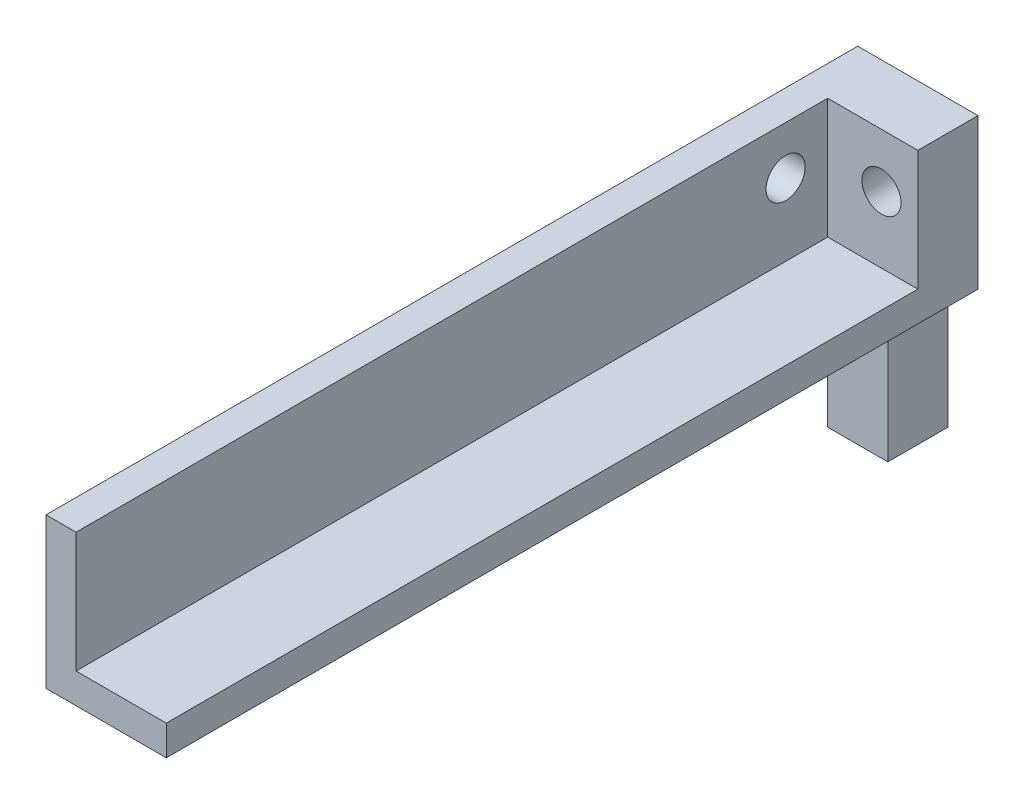
ISO-10303-21;
HEADER;
FILE_DESCRIPTION(('STEP AP214'),'2;1');
FILE_NAME('part.step','',(''),(''),'','','');
FILE_SCHEMA(('AUTOMOTIVE_DESIGN { 1 0 10303 214 1 1 1 1 }'));
ENDSEC;
DATA;
#1=APPLICATION_CONTEXT('core data for automotive mechanical design processes');
#2=APPLICATION_PROTOCOL_DEFINITION('international standard','automotive_design',2000,#1);
#3=PRODUCT_CONTEXT('',#1,'mechanical');
#4=PRODUCT('Part','Part','',(#3));
#5=PRODUCT_RELATED_PRODUCT_CATEGORY('part','',(#4));
#6=PRODUCT_DEFINITION_FORMATION('','',#4);
#7=PRODUCT_DEFINITION_CONTEXT('part definition',#1,'design');
#8=PRODUCT_DEFINITION('design','',#6,#7);
#9=PRODUCT_DEFINITION_SHAPE('','',#8);
#10=(LENGTH_UNIT() NAMED_UNIT(*) SI_UNIT(.MILLI.,.METRE.));
#11=(NAMED_UNIT(*) PLANE_ANGLE_UNIT() SI_UNIT($,.RADIAN.));
#12=(NAMED_UNIT(*) SI_UNIT($,.STERADIAN.) SOLID_ANGLE_UNIT());
#13=UNCERTAINTY_MEASURE_WITH_UNIT(LENGTH_MEASURE(1.E-05),#10,'distance_accuracy_value','');
#14=(GEOMETRIC_REPRESENTATION_CONTEXT(3) GLOBAL_UNCERTAINTY_ASSIGNED_CONTEXT((#13)) GLOBAL_UNIT_ASSIGNED_CONTEXT((#10,
#11,#12)) REPRESENTATION_CONTEXT('',''));
#15=CARTESIAN_POINT('',(0.,0.,0.));
#16=DIRECTION('',(0.,0.,1.));
#17=DIRECTION('',(1.,0.,0.));
#18=AXIS2_PLACEMENT_3D('',#15,#16,#17);
#19=CARTESIAN_POINT('',(0.,0.,0.));
#20=DIRECTION('',(1.,0.,0.));
#21=DIRECTION('',(0.,0.,-1.));
#22=AXIS2_PLACEMENT_3D('',#19,#20,#21);
#23=PLANE('',#22);
#24=DIRECTION('',(0.,0.,1.));
#25=VECTOR('',#24,1.);
#26=CARTESIAN_POINT('',(0.,-25.,0.));
#27=LINE('',#26,#25);
#28=CARTESIAN_POINT('',(0.,-25.,0.));
#29=VERTEX_POINT('',#28);
#30=CARTESIAN_POINT('',(0.,-25.,10.));
#31=VERTEX_POINT('',#30);
#32=EDGE_CURVE('E187',#29,#31,#27,.T.);
#33=ORIENTED_EDGE('',*,*,#32,.F.);
#34=DIRECTION('',(0.,1.,0.));
#35=VECTOR('',#34,1.);
#36=CARTESIAN_POINT('',(0.,-47.38,0.));
#37=LINE('',#36,#35);
#38=CARTESIAN_POINT('',(0.,-47.38,0.));
#39=VERTEX_POINT('',#38);
#40=EDGE_CURVE('E200',#39,#29,#37,.T.);
#41=ORIENTED_EDGE('',*,*,#40,.F.);
#42=DIRECTION('',(0.,0.,-1.));
#43=VECTOR('',#42,1.);
#44=CARTESIAN_POINT('',(0.,-47.38,10.));
#45=LINE('',#44,#43);
#46=CARTESIAN_POINT('',(0.,-47.38,10.));
#47=VERTEX_POINT('',#46);
#48=EDGE_CURVE('E80',#47,#39,#45,.T.);
#49=ORIENTED_EDGE('',*,*,#48,.F.);
#50=DIRECTION('',(0.,-1.,0.));
#51=VECTOR('',#50,1.);
#52=CARTESIAN_POINT('',(0.,-25.,10.));
#53=LINE('',#52,#51);
#54=EDGE_CURVE('E75',#31,#47,#53,.T.);
#55=ORIENTED_EDGE('',*,*,#54,.F.);
#56=EDGE_LOOP('',(#33,#41,#49,#55));
#57=FACE_BOUND('',#56,.T.);
#58=ADVANCED_FACE('F41',(#57),#23,.F.);
#59=CARTESIAN_POINT('',(10.,-47.38,0.));
#60=DIRECTION('',(0.,0.,1.));
#61=DIRECTION('',(1.,0.,0.));
#62=AXIS2_PLACEMENT_3D('',#59,#60,#61);
#63=PLANE('',#62);
#64=CARTESIAN_POINT('',(8.95591271117818,-8.96407559332879,0.));
#65=DIRECTION('',(0.,0.,1.));
#66=DIRECTION('',(1.,0.,0.));
#67=AXIS2_PLACEMENT_3D('',#64,#65,#66);
#68=CIRCLE('',#67,3.25000000000005);
#69=CARTESIAN_POINT('',(12.2059127111782,-8.96407559332879,0.));
#70=VERTEX_POINT('',#69);
#71=EDGE_CURVE('E154',#70,#70,#68,.F.);
#72=ORIENTED_EDGE('',*,*,#71,.F.);
#73=EDGE_LOOP('',(#72));
#74=FACE_BOUND('',#73,.T.);
#75=ORIENTED_EDGE('',*,*,#40,.T.);
#76=DIRECTION('',(1.,0.,0.));
#77=VECTOR('',#76,1.);
#78=CARTESIAN_POINT('',(-5.,-25.,0.));
#79=LINE('',#78,#77);
#80=CARTESIAN_POINT('',(-5.,-25.,0.));
#81=VERTEX_POINT('',#80);
#82=EDGE_CURVE('E196',#81,#29,#79,.T.);
#83=ORIENTED_EDGE('',*,*,#82,.F.);
#84=DIRECTION('',(0.,-1.,0.));
#85=VECTOR('',#84,1.);
#86=CARTESIAN_POINT('',(-5.,0.,0.));
#87=LINE('',#86,#85);
#88=CARTESIAN_POINT('',(-5.,0.,0.));
#89=VERTEX_POINT('',#88);
#90=EDGE_CURVE('E188',#89,#81,#87,.T.);
#91=ORIENTED_EDGE('',*,*,#90,.F.);
#92=DIRECTION('',(-1.,0.,0.));
#93=VECTOR('',#92,1.);
#94=CARTESIAN_POINT('',(10.,0.,0.));
#95=LINE('',#94,#93);
#96=CARTESIAN_POINT('',(15.,0.,0.));
#97=VERTEX_POINT('',#96);
#98=EDGE_CURVE('E51',#97,#89,#95,.T.);
#99=ORIENTED_EDGE('',*,*,#98,.F.);
#100=DIRECTION('',(0.,1.,0.));
#101=VECTOR('',#100,1.);
#102=CARTESIAN_POINT('',(15.,-25.,0.));
#103=LINE('',#102,#101);
#104=CARTESIAN_POINT('',(15.,-25.,0.));
#105=VERTEX_POINT('',#104);
#106=EDGE_CURVE('E181',#105,#97,#103,.T.);
#107=ORIENTED_EDGE('',*,*,#106,.F.);
#108=DIRECTION('',(-1.,0.,0.));
#109=VECTOR('',#108,1.);
#110=CARTESIAN_POINT('',(15.,-25.,0.));
#111=LINE('',#110,#109);
#112=CARTESIAN_POINT('',(10.,-25.,0.));
#113=VERTEX_POINT('',#112);
#114=EDGE_CURVE('E183',#105,#113,#111,.T.);
#115=ORIENTED_EDGE('',*,*,#114,.T.);
#116=DIRECTION('',(0.,1.,0.));
#117=VECTOR('',#116,1.);
#118=CARTESIAN_POINT('',(10.,-47.38,0.));
#119=LINE('',#118,#117);
#120=CARTESIAN_POINT('',(10.,-47.38,0.));
#121=VERTEX_POINT('',#120);
#122=EDGE_CURVE('E201',#121,#113,#119,.T.);
#123=ORIENTED_EDGE('',*,*,#122,.F.);
#124=DIRECTION('',(-1.,0.,0.));
#125=VECTOR('',#124,1.);
#126=CARTESIAN_POINT('',(10.,-47.38,0.));
#127=LINE('',#126,#125);
#128=EDGE_CURVE('E206',#121,#39,#127,.T.);
#129=ORIENTED_EDGE('',*,*,#128,.T.);
#130=EDGE_LOOP('',(#75,#83,#91,#99,#107,#115,#123,#129));
#131=FACE_BOUND('',#130,.T.);
#132=ADVANCED_FACE('F43',(#74,#131),#63,.F.);
#133=CARTESIAN_POINT('',(10.,0.,0.));
#134=DIRECTION('',(0.,-1.,0.));
#135=DIRECTION('',(0.,0.,-1.));
#136=AXIS2_PLACEMENT_3D('',#133,#134,#135);
#137=PLANE('',#136);
#138=ORIENTED_EDGE('',*,*,#98,.T.);
#139=DIRECTION('',(0.,0.,-1.));
#140=VECTOR('',#139,1.);
#141=CARTESIAN_POINT('',(-5.,0.,0.));
#142=LINE('',#141,#140);
#143=CARTESIAN_POINT('',(-5.,0.,135.));
#144=VERTEX_POINT('',#143);
#145=EDGE_CURVE('E193',#144,#89,#142,.T.);
#146=ORIENTED_EDGE('',*,*,#145,.F.);
#147=DIRECTION('',(-1.,0.,0.));
#148=VECTOR('',#147,1.);
#149=CARTESIAN_POINT('',(0.,0.,135.));
#150=LINE('',#149,#148);
#151=CARTESIAN_POINT('',(0.,0.,135.));
#152=VERTEX_POINT('',#151);
#153=EDGE_CURVE('E153',#152,#144,#150,.T.);
#154=ORIENTED_EDGE('',*,*,#153,.F.);
#155=DIRECTION('',(0.,0.,-1.));
#156=VECTOR('',#155,1.);
#157=CARTESIAN_POINT('',(0.,0.,0.));
#158=LINE('',#157,#156);
#159=CARTESIAN_POINT('',(0.,0.,10.));
#160=VERTEX_POINT('',#159);
#161=EDGE_CURVE('E149',#152,#160,#158,.T.);
#162=ORIENTED_EDGE('',*,*,#161,.T.);
#163=DIRECTION('',(-1.,0.,0.));
#164=VECTOR('',#163,1.);
#165=CARTESIAN_POINT('',(10.,0.,10.));
#166=LINE('',#165,#164);
#167=CARTESIAN_POINT('',(15.,0.,10.));
#168=VERTEX_POINT('',#167);
#169=EDGE_CURVE('E218',#168,#160,#166,.T.);
#170=ORIENTED_EDGE('',*,*,#169,.F.);
#171=DIRECTION('',(0.,0.,1.));
#172=VECTOR('',#171,1.);
#173=CARTESIAN_POINT('',(15.,0.,0.));
#174=LINE('',#173,#172);
#175=EDGE_CURVE('E160',#97,#168,#174,.T.);
#176=ORIENTED_EDGE('',*,*,#175,.F.);
#177=EDGE_LOOP('',(#138,#146,#154,#162,#170,#176));
#178=FACE_BOUND('',#177,.T.);
#179=ADVANCED_FACE('F257',(#178),#137,.F.);
#180=CARTESIAN_POINT('',(10.,0.,10.));
#181=DIRECTION('',(0.,0.,-1.));
#182=DIRECTION('',(0.,1.,0.));
#183=AXIS2_PLACEMENT_3D('',#180,#181,#182);
#184=PLANE('',#183);
#185=CARTESIAN_POINT('',(8.95591271117818,-8.96407559332879,10.));
#186=DIRECTION('',(0.,0.,-1.));
#187=DIRECTION('',(0.,1.,0.));
#188=AXIS2_PLACEMENT_3D('',#185,#186,#187);
#189=CIRCLE('',#188,3.25000000000005);
#190=CARTESIAN_POINT('',(8.95591271117818,-5.71407559332874,10.));
#191=VERTEX_POINT('',#190);
#192=EDGE_CURVE('E221',#191,#191,#189,.F.);
#193=ORIENTED_EDGE('',*,*,#192,.F.);
#194=EDGE_LOOP('',(#193));
#195=FACE_BOUND('',#194,.T.);
#196=DIRECTION('',(0.,-1.,0.));
#197=VECTOR('',#196,1.);
#198=CARTESIAN_POINT('',(0.,0.,10.));
#199=LINE('',#198,#197);
#200=CARTESIAN_POINT('',(0.,-20.,10.));
#201=VERTEX_POINT('',#200);
#202=EDGE_CURVE('E143',#160,#201,#199,.T.);
#203=ORIENTED_EDGE('',*,*,#202,.T.);
#204=DIRECTION('',(-1.,0.,0.));
#205=VECTOR('',#204,1.);
#206=CARTESIAN_POINT('',(10.,-20.,10.));
#207=LINE('',#206,#205);
#208=CARTESIAN_POINT('',(15.,-20.,10.));
#209=VERTEX_POINT('',#208);
#210=EDGE_CURVE('E140',#209,#201,#207,.T.);
#211=ORIENTED_EDGE('',*,*,#210,.F.);
#212=DIRECTION('',(0.,-1.,0.));
#213=VECTOR('',#212,1.);
#214=CARTESIAN_POINT('',(15.,0.,10.));
#215=LINE('',#214,#213);
#216=EDGE_CURVE('E163',#168,#209,#215,.T.);
#217=ORIENTED_EDGE('',*,*,#216,.F.);
#218=ORIENTED_EDGE('',*,*,#169,.T.);
#219=EDGE_LOOP('',(#203,#211,#217,#218));
#220=FACE_BOUND('',#219,.T.);
#221=ADVANCED_FACE('F271',(#195,#220),#184,.F.);
#222=CARTESIAN_POINT('',(10.,-20.,10.));
#223=DIRECTION('',(0.,-1.,0.));
#224=DIRECTION('',(0.,0.,-1.));
#225=AXIS2_PLACEMENT_3D('',#222,#223,#224);
#226=PLANE('',#225);
#227=DIRECTION('',(0.,0.,1.));
#228=VECTOR('',#227,1.);
#229=CARTESIAN_POINT('',(0.,-20.,10.));
#230=LINE('',#229,#228);
#231=CARTESIAN_POINT('',(0.,-20.,135.));
#232=VERTEX_POINT('',#231);
#233=EDGE_CURVE('E133',#201,#232,#230,.T.);
#234=ORIENTED_EDGE('',*,*,#233,.T.);
#235=DIRECTION('',(-1.,0.,0.));
#236=VECTOR('',#235,1.);
#237=CARTESIAN_POINT('',(15.,-20.,135.));
#238=LINE('',#237,#236);
#239=CARTESIAN_POINT('',(15.,-20.,135.));
#240=VERTEX_POINT('',#239);
#241=EDGE_CURVE('E138',#240,#232,#238,.T.);
#242=ORIENTED_EDGE('',*,*,#241,.F.);
#243=DIRECTION('',(0.,0.,1.));
#244=VECTOR('',#243,1.);
#245=CARTESIAN_POINT('',(15.,-20.,10.));
#246=LINE('',#245,#244);
#247=EDGE_CURVE('E177',#209,#240,#246,.T.);
#248=ORIENTED_EDGE('',*,*,#247,.F.);
#249=ORIENTED_EDGE('',*,*,#210,.T.);
#250=EDGE_LOOP('',(#234,#242,#248,#249));
#251=FACE_BOUND('',#250,.T.);
#252=ADVANCED_FACE('F135',(#251),#226,.F.);
#253=CARTESIAN_POINT('',(10.,-25.,30.));
#254=DIRECTION('',(0.,1.,0.));
#255=DIRECTION('',(0.,0.,1.));
#256=AXIS2_PLACEMENT_3D('',#253,#254,#255);
#257=PLANE('',#256);
#258=DIRECTION('',(0.,0.,-1.));
#259=VECTOR('',#258,1.);
#260=CARTESIAN_POINT('',(15.,-25.,30.));
#261=LINE('',#260,#259);
#262=CARTESIAN_POINT('',(15.,-25.,135.));
#263=VERTEX_POINT('',#262);
#264=EDGE_CURVE('E179',#263,#105,#261,.T.);
#265=ORIENTED_EDGE('',*,*,#264,.F.);
#266=DIRECTION('',(1.,0.,0.));
#267=VECTOR('',#266,1.);
#268=CARTESIAN_POINT('',(-5.,-25.,135.));
#269=LINE('',#268,#267);
#270=CARTESIAN_POINT('',(-5.,-25.,135.));
#271=VERTEX_POINT('',#270);
#272=EDGE_CURVE('E165',#271,#263,#269,.T.);
#273=ORIENTED_EDGE('',*,*,#272,.F.);
#274=DIRECTION('',(0.,0.,1.));
#275=VECTOR('',#274,1.);
#276=CARTESIAN_POINT('',(-5.,-25.,0.));
#277=LINE('',#276,#275);
#278=EDGE_CURVE('E191',#81,#271,#277,.T.);
#279=ORIENTED_EDGE('',*,*,#278,.F.);
#280=ORIENTED_EDGE('',*,*,#82,.T.);
#281=ORIENTED_EDGE('',*,*,#32,.T.);
#282=DIRECTION('',(-1.,0.,0.));
#283=VECTOR('',#282,1.);
#284=CARTESIAN_POINT('',(10.,-25.,10.));
#285=LINE('',#284,#283);
#286=CARTESIAN_POINT('',(10.,-25.,10.));
#287=VERTEX_POINT('',#286);
#288=EDGE_CURVE('E215',#287,#31,#285,.T.);
#289=ORIENTED_EDGE('',*,*,#288,.F.);
#290=DIRECTION('',(0.,0.,-1.));
#291=VECTOR('',#290,1.);
#292=CARTESIAN_POINT('',(10.,-25.,10.));
#293=LINE('',#292,#291);
#294=EDGE_CURVE('E11',#287,#113,#293,.T.);
#295=ORIENTED_EDGE('',*,*,#294,.T.);
#296=ORIENTED_EDGE('',*,*,#114,.F.);
#297=EDGE_LOOP('',(#265,#273,#279,#280,#281,#289,#295,#296));
#298=FACE_BOUND('',#297,.T.);
#299=ADVANCED_FACE('F265',(#298),#257,.F.);
#300=CARTESIAN_POINT('',(10.,-25.,10.));
#301=DIRECTION('',(0.,0.,-1.));
#302=DIRECTION('',(0.,1.,0.));
#303=AXIS2_PLACEMENT_3D('',#300,#301,#302);
#304=PLANE('',#303);
#305=ORIENTED_EDGE('',*,*,#54,.T.);
#306=DIRECTION('',(-1.,0.,0.));
#307=VECTOR('',#306,1.);
#308=CARTESIAN_POINT('',(10.,-47.38,10.));
#309=LINE('',#308,#307);
#310=CARTESIAN_POINT('',(10.,-47.38,10.));
#311=VERTEX_POINT('',#310);
#312=EDGE_CURVE('E213',#311,#47,#309,.T.);
#313=ORIENTED_EDGE('',*,*,#312,.F.);
#314=DIRECTION('',(0.,-1.,0.));
#315=VECTOR('',#314,1.);
#316=CARTESIAN_POINT('',(10.,-25.,10.));
#317=LINE('',#316,#315);
#318=EDGE_CURVE('E203',#287,#311,#317,.T.);
#319=ORIENTED_EDGE('',*,*,#318,.F.);
#320=ORIENTED_EDGE('',*,*,#288,.T.);
#321=EDGE_LOOP('',(#305,#313,#319,#320));
#322=FACE_BOUND('',#321,.T.);
#323=ADVANCED_FACE('F263',(#322),#304,.F.);
#324=CARTESIAN_POINT('',(10.,-47.38,10.));
#325=DIRECTION('',(0.,1.,0.));
#326=DIRECTION('',(0.,0.,1.));
#327=AXIS2_PLACEMENT_3D('',#324,#325,#326);
#328=PLANE('',#327);
#329=ORIENTED_EDGE('',*,*,#48,.T.);
#330=ORIENTED_EDGE('',*,*,#128,.F.);
#331=DIRECTION('',(0.,0.,-1.));
#332=VECTOR('',#331,1.);
#333=CARTESIAN_POINT('',(10.,-47.38,10.));
#334=LINE('',#333,#332);
#335=EDGE_CURVE('E60',#311,#121,#334,.T.);
#336=ORIENTED_EDGE('',*,*,#335,.F.);
#337=ORIENTED_EDGE('',*,*,#312,.T.);
#338=EDGE_LOOP('',(#329,#330,#336,#337));
#339=FACE_BOUND('',#338,.T.);
#340=ADVANCED_FACE('F261',(#339),#328,.F.);
#341=CARTESIAN_POINT('',(10.,0.,0.));
#342=DIRECTION('',(1.,0.,0.));
#343=DIRECTION('',(0.,0.,-1.));
#344=AXIS2_PLACEMENT_3D('',#341,#342,#343);
#345=PLANE('',#344);
#346=ORIENTED_EDGE('',*,*,#294,.F.);
#347=ORIENTED_EDGE('',*,*,#318,.T.);
#348=ORIENTED_EDGE('',*,*,#335,.T.);
#349=ORIENTED_EDGE('',*,*,#122,.T.);
#350=EDGE_LOOP('',(#346,#347,#348,#349));
#351=FACE_BOUND('',#350,.T.);
#352=ADVANCED_FACE('F246',(#351),#345,.T.);
#353=CARTESIAN_POINT('',(-5.,0.,0.));
#354=DIRECTION('',(-1.,0.,0.));
#355=DIRECTION('',(0.,0.,1.));
#356=AXIS2_PLACEMENT_3D('',#353,#354,#355);
#357=PLANE('',#356);
#358=CARTESIAN_POINT('',(-5.,-8.00000000000014,17.));
#359=DIRECTION('',(-1.,0.,0.));
#360=DIRECTION('',(0.,0.,1.));
#361=AXIS2_PLACEMENT_3D('',#358,#359,#360);
#362=CIRCLE('',#361,3.25000000000001);
#363=CARTESIAN_POINT('',(-5.,-8.00000000000014,20.25));
#364=VERTEX_POINT('',#363);
#365=EDGE_CURVE('E223',#364,#364,#362,.F.);
#366=ORIENTED_EDGE('',*,*,#365,.T.);
#367=EDGE_LOOP('',(#366));
#368=FACE_BOUND('',#367,.T.);
#369=ORIENTED_EDGE('',*,*,#90,.T.);
#370=ORIENTED_EDGE('',*,*,#278,.T.);
#371=DIRECTION('',(0.,-1.,0.));
#372=VECTOR('',#371,1.);
#373=CARTESIAN_POINT('',(-5.,0.,135.));
#374=LINE('',#373,#372);
#375=EDGE_CURVE('E171',#144,#271,#374,.T.);
#376=ORIENTED_EDGE('',*,*,#375,.F.);
#377=ORIENTED_EDGE('',*,*,#145,.T.);
#378=EDGE_LOOP('',(#369,#370,#376,#377));
#379=FACE_BOUND('',#378,.T.);
#380=ADVANCED_FACE('F237',(#368,#379),#357,.T.);
#381=CARTESIAN_POINT('',(0.,0.,0.));
#382=DIRECTION('',(-1.,0.,0.));
#383=DIRECTION('',(0.,0.,1.));
#384=AXIS2_PLACEMENT_3D('',#381,#382,#383);
#385=PLANE('',#384);
#386=CARTESIAN_POINT('',(0.,-8.00000000000014,17.));
#387=DIRECTION('',(-1.,0.,0.));
#388=DIRECTION('',(0.,0.,1.));
#389=AXIS2_PLACEMENT_3D('',#386,#387,#388);
#390=CIRCLE('',#389,3.25000000000001);
#391=CARTESIAN_POINT('',(0.,-8.00000000000014,20.25));
#392=VERTEX_POINT('',#391);
#393=EDGE_CURVE('E45',#392,#392,#390,.F.);
#394=ORIENTED_EDGE('',*,*,#393,.F.);
#395=EDGE_LOOP('',(#394));
#396=FACE_BOUND('',#395,.T.);
#397=ORIENTED_EDGE('',*,*,#233,.F.);
#398=ORIENTED_EDGE('',*,*,#202,.F.);
#399=ORIENTED_EDGE('',*,*,#161,.F.);
#400=DIRECTION('',(0.,1.,0.));
#401=VECTOR('',#400,1.);
#402=CARTESIAN_POINT('',(0.,-20.,135.));
#403=LINE('',#402,#401);
#404=EDGE_CURVE('E146',#232,#152,#403,.T.);
#405=ORIENTED_EDGE('',*,*,#404,.F.);
#406=EDGE_LOOP('',(#397,#398,#399,#405));
#407=FACE_BOUND('',#406,.T.);
#408=ADVANCED_FACE('F147',(#396,#407),#385,.F.);
#409=CARTESIAN_POINT('',(15.,0.,0.));
#410=DIRECTION('',(1.,0.,0.));
#411=DIRECTION('',(0.,0.,-1.));
#412=AXIS2_PLACEMENT_3D('',#409,#410,#411);
#413=PLANE('',#412);
#414=ORIENTED_EDGE('',*,*,#175,.T.);
#415=ORIENTED_EDGE('',*,*,#216,.T.);
#416=ORIENTED_EDGE('',*,*,#247,.T.);
#417=DIRECTION('',(0.,1.,0.));
#418=VECTOR('',#417,1.);
#419=CARTESIAN_POINT('',(15.,-25.,135.));
#420=LINE('',#419,#418);
#421=EDGE_CURVE('E159',#263,#240,#420,.T.);
#422=ORIENTED_EDGE('',*,*,#421,.F.);
#423=ORIENTED_EDGE('',*,*,#264,.T.);
#424=ORIENTED_EDGE('',*,*,#106,.T.);
#425=EDGE_LOOP('',(#414,#415,#416,#422,#423,#424));
#426=FACE_BOUND('',#425,.T.);
#427=ADVANCED_FACE('F236',(#426),#413,.T.);
#428=CARTESIAN_POINT('',(0.,-19.9999999999999,135.));
#429=DIRECTION('',(0.,0.,1.));
#430=DIRECTION('',(0.00400138533209116,0.999991994425667,0.));
#431=AXIS2_PLACEMENT_3D('',#428,#429,#430);
#432=PLANE('',#431);
#433=ORIENTED_EDGE('',*,*,#404,.T.);
#434=ORIENTED_EDGE('',*,*,#153,.T.);
#435=ORIENTED_EDGE('',*,*,#375,.T.);
#436=ORIENTED_EDGE('',*,*,#272,.T.);
#437=ORIENTED_EDGE('',*,*,#421,.T.);
#438=ORIENTED_EDGE('',*,*,#241,.T.);
#439=EDGE_LOOP('',(#433,#434,#435,#436,#437,#438));
#440=FACE_BOUND('',#439,.T.);
#441=ADVANCED_FACE('F156',(#440),#432,.T.);
#442=CARTESIAN_POINT('',(8.95591271117818,-8.96407559332879,-15.));
#443=DIRECTION('',(0.,0.,1.));
#444=DIRECTION('',(1.,0.,0.));
#445=AXIS2_PLACEMENT_3D('',#442,#443,#444);
#446=CYLINDRICAL_SURFACE('',#445,3.25000000000005);
#447=ORIENTED_EDGE('',*,*,#192,.T.);
#448=EDGE_LOOP('',(#447));
#449=FACE_BOUND('',#448,.T.);
#450=ORIENTED_EDGE('',*,*,#71,.T.);
#451=EDGE_LOOP('',(#450));
#452=FACE_BOUND('',#451,.T.);
#453=ADVANCED_FACE('F346',(#449,#452),#446,.F.);
#454=CARTESIAN_POINT('',(-22.,-8.00000000000014,17.));
#455=DIRECTION('',(1.,0.,0.));
#456=DIRECTION('',(0.,0.,-1.));
#457=AXIS2_PLACEMENT_3D('',#454,#455,#456);
#458=CYLINDRICAL_SURFACE('',#457,3.25000000000001);
#459=ORIENTED_EDGE('',*,*,#365,.F.);
#460=EDGE_LOOP('',(#459));
#461=FACE_BOUND('',#460,.T.);
#462=ORIENTED_EDGE('',*,*,#393,.T.);
#463=EDGE_LOOP('',(#462));
#464=FACE_BOUND('',#463,.T.);
#465=ADVANCED_FACE('F233',(#461,#464),#458,.F.);
#466=CLOSED_SHELL('',(#58,#132,#179,#221,#252,#299,#323,#340,#352,#380,#408,#427,#441,#453,#465));
#467=MANIFOLD_SOLID_BREP('B2',#466);
#468=ADVANCED_BREP_SHAPE_REPRESENTATION('',(#18,#467),#14);
#469=SHAPE_DEFINITION_REPRESENTATION(#9,#468);
ENDSEC;
END-ISO-10303-21;
